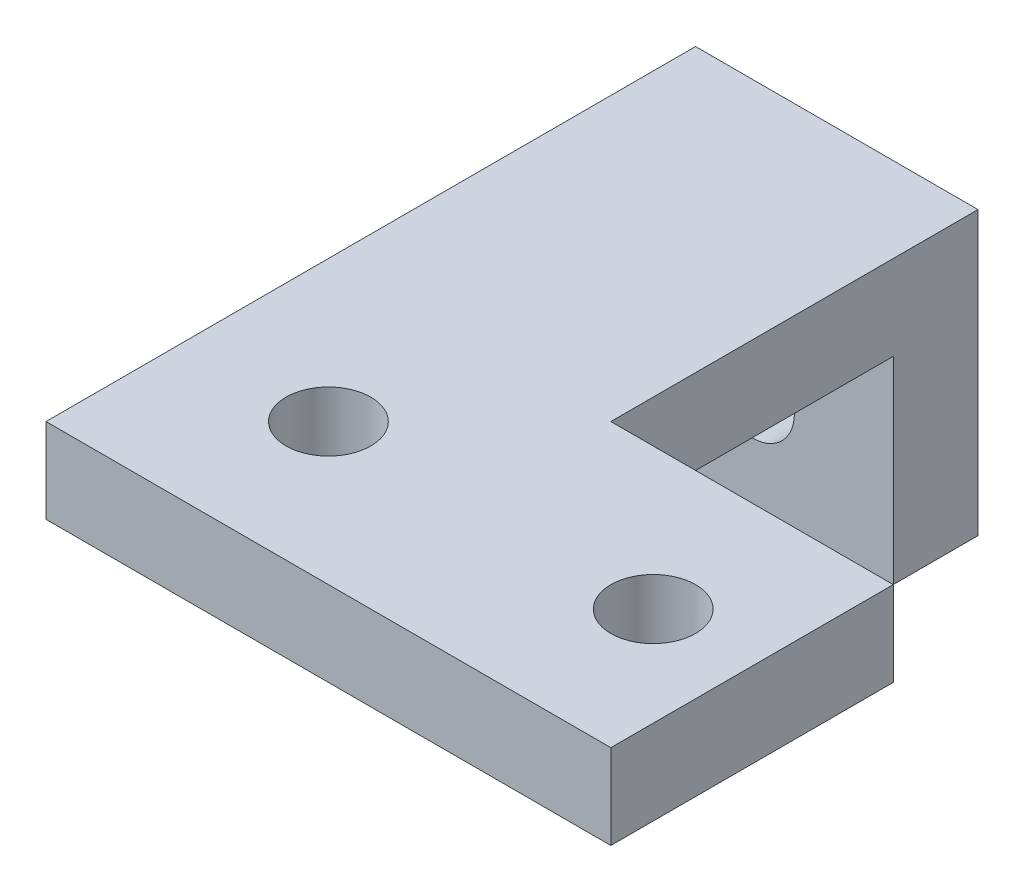
ISO-10303-21;
HEADER;
FILE_DESCRIPTION(('STEP AP214'),'2;1');
FILE_NAME('part.step','',(''),(''),'','','');
FILE_SCHEMA(('AUTOMOTIVE_DESIGN { 1 0 10303 214 1 1 1 1 }'));
ENDSEC;
DATA;
#1=APPLICATION_CONTEXT('core data for automotive mechanical design processes');
#2=APPLICATION_PROTOCOL_DEFINITION('international standard','automotive_design',2000,#1);
#3=PRODUCT_CONTEXT('',#1,'mechanical');
#4=PRODUCT('Part','Part','',(#3));
#5=PRODUCT_RELATED_PRODUCT_CATEGORY('part','',(#4));
#6=PRODUCT_DEFINITION_FORMATION('','',#4);
#7=PRODUCT_DEFINITION_CONTEXT('part definition',#1,'design');
#8=PRODUCT_DEFINITION('design','',#6,#7);
#9=PRODUCT_DEFINITION_SHAPE('','',#8);
#10=(LENGTH_UNIT() NAMED_UNIT(*) SI_UNIT(.MILLI.,.METRE.));
#11=(NAMED_UNIT(*) PLANE_ANGLE_UNIT() SI_UNIT($,.RADIAN.));
#12=(NAMED_UNIT(*) SI_UNIT($,.STERADIAN.) SOLID_ANGLE_UNIT());
#13=UNCERTAINTY_MEASURE_WITH_UNIT(LENGTH_MEASURE(1.E-05),#10,'distance_accuracy_value','');
#14=(GEOMETRIC_REPRESENTATION_CONTEXT(3) GLOBAL_UNCERTAINTY_ASSIGNED_CONTEXT((#13)) GLOBAL_UNIT_ASSIGNED_CONTEXT((#10,
#11,#12)) REPRESENTATION_CONTEXT('',''));
#15=CARTESIAN_POINT('',(0.,0.,0.));
#16=DIRECTION('',(0.,0.,1.));
#17=DIRECTION('',(1.,0.,0.));
#18=AXIS2_PLACEMENT_3D('',#15,#16,#17);
#19=CARTESIAN_POINT('',(9.99999999999979,3.,0.));
#20=DIRECTION('',(0.,0.,1.));
#21=DIRECTION('',(1.,0.,0.));
#22=AXIS2_PLACEMENT_3D('',#19,#20,#21);
#23=PLANE('',#22);
#24=DIRECTION('',(-1.,0.,0.));
#25=VECTOR('',#24,1.);
#26=CARTESIAN_POINT('',(9.99999999999979,0.,0.));
#27=LINE('',#26,#25);
#28=CARTESIAN_POINT('',(9.99999999999979,0.,0.));
#29=VERTEX_POINT('',#28);
#30=CARTESIAN_POINT('',(0.,0.,0.));
#31=VERTEX_POINT('',#30);
#32=EDGE_CURVE('E141',#29,#31,#27,.T.);
#33=ORIENTED_EDGE('',*,*,#32,.T.);
#34=DIRECTION('',(0.,-1.,0.));
#35=VECTOR('',#34,1.);
#36=CARTESIAN_POINT('',(0.,3.,0.));
#37=LINE('',#36,#35);
#38=CARTESIAN_POINT('',(0.,3.,0.));
#39=VERTEX_POINT('',#38);
#40=EDGE_CURVE('E11',#39,#31,#37,.T.);
#41=ORIENTED_EDGE('',*,*,#40,.F.);
#42=DIRECTION('',(-1.,0.,0.));
#43=VECTOR('',#42,1.);
#44=CARTESIAN_POINT('',(9.99999999999979,3.,0.));
#45=LINE('',#44,#43);
#46=CARTESIAN_POINT('',(9.99999999999979,3.,0.));
#47=VERTEX_POINT('',#46);
#48=EDGE_CURVE('E146',#47,#39,#45,.T.);
#49=ORIENTED_EDGE('',*,*,#48,.F.);
#50=DIRECTION('',(0.,-1.,0.));
#51=VECTOR('',#50,1.);
#52=CARTESIAN_POINT('',(9.99999999999979,3.,0.));
#53=LINE('',#52,#51);
#54=EDGE_CURVE('E154',#47,#29,#53,.T.);
#55=ORIENTED_EDGE('',*,*,#54,.T.);
#56=EDGE_LOOP('',(#33,#41,#49,#55));
#57=FACE_BOUND('',#56,.T.);
#58=ADVANCED_FACE('F33',(#57),#23,.F.);
#59=CARTESIAN_POINT('',(0.,3.,0.));
#60=DIRECTION('',(-1.,0.,0.));
#61=DIRECTION('',(0.,0.,1.));
#62=AXIS2_PLACEMENT_3D('',#59,#60,#61);
#63=PLANE('',#62);
#64=DIRECTION('',(0.,0.,-1.));
#65=VECTOR('',#64,1.);
#66=CARTESIAN_POINT('',(0.,0.,0.));
#67=LINE('',#66,#65);
#68=CARTESIAN_POINT('',(-2.1163626406917E-13,0.,-9.99999999999998));
#69=VERTEX_POINT('',#68);
#70=EDGE_CURVE('E157',#31,#69,#67,.T.);
#71=ORIENTED_EDGE('',*,*,#70,.T.);
#72=DIRECTION('',(0.,1.,0.));
#73=VECTOR('',#72,1.);
#74=CARTESIAN_POINT('',(-2.1163626406917E-13,-7.,-9.99999999999998));
#75=LINE('',#74,#73);
#76=CARTESIAN_POINT('',(-2.1163626406917E-13,-7.,-9.99999999999998));
#77=VERTEX_POINT('',#76);
#78=EDGE_CURVE('E130',#77,#69,#75,.T.);
#79=ORIENTED_EDGE('',*,*,#78,.F.);
#80=DIRECTION('',(0.,0.,-1.));
#81=VECTOR('',#80,1.);
#82=CARTESIAN_POINT('',(-2.1163626406917E-13,-7.,-9.99999999999998));
#83=LINE('',#82,#81);
#84=CARTESIAN_POINT('',(-2.1163626406917E-13,-7.,-13.));
#85=VERTEX_POINT('',#84);
#86=EDGE_CURVE('E123',#77,#85,#83,.T.);
#87=ORIENTED_EDGE('',*,*,#86,.T.);
#88=DIRECTION('',(0.,1.,0.));
#89=VECTOR('',#88,1.);
#90=CARTESIAN_POINT('',(-2.1163626406917E-13,-7.,-13.));
#91=LINE('',#90,#89);
#92=CARTESIAN_POINT('',(-2.1163626406917E-13,3.,-13.));
#93=VERTEX_POINT('',#92);
#94=EDGE_CURVE('E107',#85,#93,#91,.T.);
#95=ORIENTED_EDGE('',*,*,#94,.T.);
#96=DIRECTION('',(0.,0.,-1.));
#97=VECTOR('',#96,1.);
#98=CARTESIAN_POINT('',(0.,3.,0.));
#99=LINE('',#98,#97);
#100=EDGE_CURVE('E83',#39,#93,#99,.T.);
#101=ORIENTED_EDGE('',*,*,#100,.F.);
#102=ORIENTED_EDGE('',*,*,#40,.T.);
#103=EDGE_LOOP('',(#71,#79,#87,#95,#101,#102));
#104=FACE_BOUND('',#103,.T.);
#105=ADVANCED_FACE('F128',(#104),#63,.F.);
#106=CARTESIAN_POINT('',(-10.0000000000002,3.,-9.99999999999998));
#107=DIRECTION('',(1.,0.,0.));
#108=DIRECTION('',(0.,0.,-1.));
#109=AXIS2_PLACEMENT_3D('',#106,#107,#108);
#110=PLANE('',#109);
#111=DIRECTION('',(0.,0.,1.));
#112=VECTOR('',#111,1.);
#113=CARTESIAN_POINT('',(-10.0000000000002,0.,-9.99999999999998));
#114=LINE('',#113,#112);
#115=CARTESIAN_POINT('',(-10.0000000000002,0.,-9.99999999999998));
#116=VERTEX_POINT('',#115);
#117=CARTESIAN_POINT('',(-10.0000000000002,0.,10.));
#118=VERTEX_POINT('',#117);
#119=EDGE_CURVE('E162',#116,#118,#114,.T.);
#120=ORIENTED_EDGE('',*,*,#119,.T.);
#121=DIRECTION('',(0.,-1.,0.));
#122=VECTOR('',#121,1.);
#123=CARTESIAN_POINT('',(-10.0000000000002,3.,10.));
#124=LINE('',#123,#122);
#125=CARTESIAN_POINT('',(-10.0000000000002,3.,10.));
#126=VERTEX_POINT('',#125);
#127=EDGE_CURVE('E41',#126,#118,#124,.T.);
#128=ORIENTED_EDGE('',*,*,#127,.F.);
#129=DIRECTION('',(0.,0.,1.));
#130=VECTOR('',#129,1.);
#131=CARTESIAN_POINT('',(-10.0000000000002,3.,-9.99999999999998));
#132=LINE('',#131,#130);
#133=CARTESIAN_POINT('',(-10.0000000000002,3.,-13.));
#134=VERTEX_POINT('',#133);
#135=EDGE_CURVE('E149',#134,#126,#132,.T.);
#136=ORIENTED_EDGE('',*,*,#135,.F.);
#137=DIRECTION('',(0.,1.,0.));
#138=VECTOR('',#137,1.);
#139=CARTESIAN_POINT('',(-10.0000000000002,-7.,-13.));
#140=LINE('',#139,#138);
#141=CARTESIAN_POINT('',(-10.0000000000002,-7.,-13.));
#142=VERTEX_POINT('',#141);
#143=EDGE_CURVE('E115',#142,#134,#140,.T.);
#144=ORIENTED_EDGE('',*,*,#143,.F.);
#145=DIRECTION('',(0.,0.,1.));
#146=VECTOR('',#145,1.);
#147=CARTESIAN_POINT('',(-10.0000000000002,-7.,-9.99999999999998));
#148=LINE('',#147,#146);
#149=CARTESIAN_POINT('',(-10.0000000000002,-7.,-9.99999999999998));
#150=VERTEX_POINT('',#149);
#151=EDGE_CURVE('E126',#142,#150,#148,.T.);
#152=ORIENTED_EDGE('',*,*,#151,.T.);
#153=DIRECTION('',(0.,1.,0.));
#154=VECTOR('',#153,1.);
#155=CARTESIAN_POINT('',(-10.0000000000002,-7.,-9.99999999999998));
#156=LINE('',#155,#154);
#157=EDGE_CURVE('E142',#150,#116,#156,.T.);
#158=ORIENTED_EDGE('',*,*,#157,.T.);
#159=EDGE_LOOP('',(#120,#128,#136,#144,#152,#158));
#160=FACE_BOUND('',#159,.T.);
#161=ADVANCED_FACE('F189',(#160),#110,.F.);
#162=CARTESIAN_POINT('',(-10.0000000000002,3.,10.));
#163=DIRECTION('',(0.,0.,-1.));
#164=DIRECTION('',(-1.,0.,0.));
#165=AXIS2_PLACEMENT_3D('',#162,#163,#164);
#166=PLANE('',#165);
#167=DIRECTION('',(1.,0.,0.));
#168=VECTOR('',#167,1.);
#169=CARTESIAN_POINT('',(-10.0000000000002,0.,10.));
#170=LINE('',#169,#168);
#171=CARTESIAN_POINT('',(9.99999999999979,0.,10.));
#172=VERTEX_POINT('',#171);
#173=EDGE_CURVE('E70',#118,#172,#170,.T.);
#174=ORIENTED_EDGE('',*,*,#173,.T.);
#175=DIRECTION('',(0.,-1.,0.));
#176=VECTOR('',#175,1.);
#177=CARTESIAN_POINT('',(9.99999999999979,3.,10.));
#178=LINE('',#177,#176);
#179=CARTESIAN_POINT('',(9.99999999999979,3.,10.));
#180=VERTEX_POINT('',#179);
#181=EDGE_CURVE('E167',#180,#172,#178,.T.);
#182=ORIENTED_EDGE('',*,*,#181,.F.);
#183=DIRECTION('',(1.,0.,0.));
#184=VECTOR('',#183,1.);
#185=CARTESIAN_POINT('',(-10.0000000000002,3.,10.));
#186=LINE('',#185,#184);
#187=EDGE_CURVE('E151',#126,#180,#186,.T.);
#188=ORIENTED_EDGE('',*,*,#187,.F.);
#189=ORIENTED_EDGE('',*,*,#127,.T.);
#190=EDGE_LOOP('',(#174,#182,#188,#189));
#191=FACE_BOUND('',#190,.T.);
#192=ADVANCED_FACE('F170',(#191),#166,.F.);
#193=CARTESIAN_POINT('',(9.99999999999979,3.,10.));
#194=DIRECTION('',(-1.,0.,0.));
#195=DIRECTION('',(0.,0.,1.));
#196=AXIS2_PLACEMENT_3D('',#193,#194,#195);
#197=PLANE('',#196);
#198=DIRECTION('',(0.,0.,-1.));
#199=VECTOR('',#198,1.);
#200=CARTESIAN_POINT('',(9.99999999999979,0.,10.));
#201=LINE('',#200,#199);
#202=EDGE_CURVE('E76',#172,#29,#201,.T.);
#203=ORIENTED_EDGE('',*,*,#202,.T.);
#204=ORIENTED_EDGE('',*,*,#54,.F.);
#205=DIRECTION('',(0.,0.,-1.));
#206=VECTOR('',#205,1.);
#207=CARTESIAN_POINT('',(9.99999999999979,3.,10.));
#208=LINE('',#207,#206);
#209=EDGE_CURVE('E49',#180,#47,#208,.T.);
#210=ORIENTED_EDGE('',*,*,#209,.F.);
#211=ORIENTED_EDGE('',*,*,#181,.T.);
#212=EDGE_LOOP('',(#203,#204,#210,#211));
#213=FACE_BOUND('',#212,.T.);
#214=ADVANCED_FACE('F179',(#213),#197,.F.);
#215=CARTESIAN_POINT('',(0.,3.,0.));
#216=DIRECTION('',(0.,-1.,0.));
#217=DIRECTION('',(0.,0.,-1.));
#218=AXIS2_PLACEMENT_3D('',#215,#216,#217);
#219=PLANE('',#218);
#220=CARTESIAN_POINT('',(-5.,3.,5.00000000000001));
#221=DIRECTION('',(0.,1.,0.));
#222=DIRECTION('',(0.,0.,1.));
#223=AXIS2_PLACEMENT_3D('',#220,#221,#222);
#224=CIRCLE('',#223,1.5);
#225=CARTESIAN_POINT('',(-5.,3.,6.50000000000001));
#226=VERTEX_POINT('',#225);
#227=EDGE_CURVE('E132',#226,#226,#224,.T.);
#228=ORIENTED_EDGE('',*,*,#227,.F.);
#229=EDGE_LOOP('',(#228));
#230=FACE_BOUND('',#229,.T.);
#231=CARTESIAN_POINT('',(6.49999999999979,3.,5.00000000000001));
#232=DIRECTION('',(0.,1.,0.));
#233=DIRECTION('',(0.,0.,1.));
#234=AXIS2_PLACEMENT_3D('',#231,#232,#233);
#235=CIRCLE('',#234,1.5);
#236=CARTESIAN_POINT('',(6.49999999999979,3.,6.50000000000001));
#237=VERTEX_POINT('',#236);
#238=EDGE_CURVE('E239',#237,#237,#235,.T.);
#239=ORIENTED_EDGE('',*,*,#238,.F.);
#240=EDGE_LOOP('',(#239));
#241=FACE_BOUND('',#240,.T.);
#242=ORIENTED_EDGE('',*,*,#48,.T.);
#243=ORIENTED_EDGE('',*,*,#100,.T.);
#244=DIRECTION('',(-1.,0.,0.));
#245=VECTOR('',#244,1.);
#246=CARTESIAN_POINT('',(-2.1163626406917E-13,3.,-13.));
#247=LINE('',#246,#245);
#248=EDGE_CURVE('E113',#93,#134,#247,.T.);
#249=ORIENTED_EDGE('',*,*,#248,.T.);
#250=ORIENTED_EDGE('',*,*,#135,.T.);
#251=ORIENTED_EDGE('',*,*,#187,.T.);
#252=ORIENTED_EDGE('',*,*,#209,.T.);
#253=EDGE_LOOP('',(#242,#243,#249,#250,#251,#252));
#254=FACE_BOUND('',#253,.T.);
#255=ADVANCED_FACE('F181',(#230,#241,#254),#219,.F.);
#256=CARTESIAN_POINT('',(0.,0.,0.));
#257=DIRECTION('',(0.,-1.,0.));
#258=DIRECTION('',(0.,0.,-1.));
#259=AXIS2_PLACEMENT_3D('',#256,#257,#258);
#260=PLANE('',#259);
#261=CARTESIAN_POINT('',(-5.,0.,5.00000000000001));
#262=DIRECTION('',(0.,-1.,0.));
#263=DIRECTION('',(0.,0.,-1.));
#264=AXIS2_PLACEMENT_3D('',#261,#262,#263);
#265=CIRCLE('',#264,1.5);
#266=CARTESIAN_POINT('',(-5.,0.,3.50000000000001));
#267=VERTEX_POINT('',#266);
#268=EDGE_CURVE('E244',#267,#267,#265,.F.);
#269=ORIENTED_EDGE('',*,*,#268,.T.);
#270=EDGE_LOOP('',(#269));
#271=FACE_BOUND('',#270,.T.);
#272=CARTESIAN_POINT('',(6.49999999999979,0.,5.00000000000001));
#273=DIRECTION('',(0.,-1.,0.));
#274=DIRECTION('',(0.,0.,-1.));
#275=AXIS2_PLACEMENT_3D('',#272,#273,#274);
#276=CIRCLE('',#275,1.5);
#277=CARTESIAN_POINT('',(6.49999999999979,0.,3.50000000000001));
#278=VERTEX_POINT('',#277);
#279=EDGE_CURVE('E135',#278,#278,#276,.F.);
#280=ORIENTED_EDGE('',*,*,#279,.T.);
#281=EDGE_LOOP('',(#280));
#282=FACE_BOUND('',#281,.T.);
#283=ORIENTED_EDGE('',*,*,#32,.F.);
#284=ORIENTED_EDGE('',*,*,#202,.F.);
#285=ORIENTED_EDGE('',*,*,#173,.F.);
#286=ORIENTED_EDGE('',*,*,#119,.F.);
#287=DIRECTION('',(-1.,0.,0.));
#288=VECTOR('',#287,1.);
#289=CARTESIAN_POINT('',(-2.1163626406917E-13,0.,-9.99999999999998));
#290=LINE('',#289,#288);
#291=EDGE_CURVE('E159',#69,#116,#290,.T.);
#292=ORIENTED_EDGE('',*,*,#291,.F.);
#293=ORIENTED_EDGE('',*,*,#70,.F.);
#294=EDGE_LOOP('',(#283,#284,#285,#286,#292,#293));
#295=FACE_BOUND('',#294,.T.);
#296=ADVANCED_FACE('F174',(#271,#282,#295),#260,.T.);
#297=CARTESIAN_POINT('',(-2.1163626406917E-13,-7.,-9.99999999999998));
#298=DIRECTION('',(0.,0.,1.));
#299=DIRECTION('',(1.,0.,0.));
#300=AXIS2_PLACEMENT_3D('',#297,#298,#299);
#301=PLANE('',#300);
#302=CARTESIAN_POINT('',(-5.00000000000021,-3.5,-9.99999999999998));
#303=DIRECTION('',(0.,0.,1.));
#304=DIRECTION('',(1.,0.,0.));
#305=AXIS2_PLACEMENT_3D('',#302,#303,#304);
#306=CIRCLE('',#305,1.5);
#307=CARTESIAN_POINT('',(-3.50000000000021,-3.5,-9.99999999999998));
#308=VERTEX_POINT('',#307);
#309=EDGE_CURVE('E233',#308,#308,#306,.F.);
#310=ORIENTED_EDGE('',*,*,#309,.T.);
#311=EDGE_LOOP('',(#310));
#312=FACE_BOUND('',#311,.T.);
#313=ORIENTED_EDGE('',*,*,#78,.T.);
#314=ORIENTED_EDGE('',*,*,#291,.T.);
#315=ORIENTED_EDGE('',*,*,#157,.F.);
#316=DIRECTION('',(1.,0.,0.));
#317=VECTOR('',#316,1.);
#318=CARTESIAN_POINT('',(-2.1163626406917E-13,-7.,-9.99999999999998));
#319=LINE('',#318,#317);
#320=EDGE_CURVE('E116',#150,#77,#319,.T.);
#321=ORIENTED_EDGE('',*,*,#320,.T.);
#322=EDGE_LOOP('',(#313,#314,#315,#321));
#323=FACE_BOUND('',#322,.T.);
#324=ADVANCED_FACE('F203',(#312,#323),#301,.T.);
#325=CARTESIAN_POINT('',(-2.1163626406917E-13,-7.,-13.));
#326=DIRECTION('',(0.,0.,-1.));
#327=DIRECTION('',(-1.,0.,0.));
#328=AXIS2_PLACEMENT_3D('',#325,#326,#327);
#329=PLANE('',#328);
#330=CARTESIAN_POINT('',(-5.00000000000021,-3.5,-13.));
#331=DIRECTION('',(0.,0.,-1.));
#332=DIRECTION('',(-1.,0.,0.));
#333=AXIS2_PLACEMENT_3D('',#330,#331,#332);
#334=CIRCLE('',#333,1.5);
#335=CARTESIAN_POINT('',(-6.50000000000021,-3.5,-13.));
#336=VERTEX_POINT('',#335);
#337=EDGE_CURVE('E236',#336,#336,#334,.T.);
#338=ORIENTED_EDGE('',*,*,#337,.F.);
#339=EDGE_LOOP('',(#338));
#340=FACE_BOUND('',#339,.T.);
#341=ORIENTED_EDGE('',*,*,#248,.F.);
#342=ORIENTED_EDGE('',*,*,#94,.F.);
#343=DIRECTION('',(-1.,0.,0.));
#344=VECTOR('',#343,1.);
#345=CARTESIAN_POINT('',(-2.1163626406917E-13,-7.,-13.));
#346=LINE('',#345,#344);
#347=EDGE_CURVE('E111',#85,#142,#346,.T.);
#348=ORIENTED_EDGE('',*,*,#347,.T.);
#349=ORIENTED_EDGE('',*,*,#143,.T.);
#350=EDGE_LOOP('',(#341,#342,#348,#349));
#351=FACE_BOUND('',#350,.T.);
#352=ADVANCED_FACE('F109',(#340,#351),#329,.T.);
#353=CARTESIAN_POINT('',(0.,-7.,0.));
#354=DIRECTION('',(0.,1.,0.));
#355=DIRECTION('',(0.,0.,1.));
#356=AXIS2_PLACEMENT_3D('',#353,#354,#355);
#357=PLANE('',#356);
#358=ORIENTED_EDGE('',*,*,#86,.F.);
#359=ORIENTED_EDGE('',*,*,#320,.F.);
#360=ORIENTED_EDGE('',*,*,#151,.F.);
#361=ORIENTED_EDGE('',*,*,#347,.F.);
#362=EDGE_LOOP('',(#358,#359,#360,#361));
#363=FACE_BOUND('',#362,.T.);
#364=ADVANCED_FACE('F121',(#363),#357,.F.);
#365=CARTESIAN_POINT('',(6.49999999999979,-7.001,5.00000000000001));
#366=DIRECTION('',(0.,1.,0.));
#367=DIRECTION('',(0.,0.,1.));
#368=AXIS2_PLACEMENT_3D('',#365,#366,#367);
#369=CYLINDRICAL_SURFACE('',#368,1.5);
#370=ORIENTED_EDGE('',*,*,#279,.F.);
#371=EDGE_LOOP('',(#370));
#372=FACE_BOUND('',#371,.T.);
#373=ORIENTED_EDGE('',*,*,#238,.T.);
#374=EDGE_LOOP('',(#373));
#375=FACE_BOUND('',#374,.T.);
#376=ADVANCED_FACE('F218',(#372,#375),#369,.F.);
#377=CARTESIAN_POINT('',(-5.,-7.001,5.00000000000001));
#378=DIRECTION('',(0.,1.,0.));
#379=DIRECTION('',(0.,0.,1.));
#380=AXIS2_PLACEMENT_3D('',#377,#378,#379);
#381=CYLINDRICAL_SURFACE('',#380,1.5);
#382=ORIENTED_EDGE('',*,*,#268,.F.);
#383=EDGE_LOOP('',(#382));
#384=FACE_BOUND('',#383,.T.);
#385=ORIENTED_EDGE('',*,*,#227,.T.);
#386=EDGE_LOOP('',(#385));
#387=FACE_BOUND('',#386,.T.);
#388=ADVANCED_FACE('F221',(#384,#387),#381,.F.);
#389=CARTESIAN_POINT('',(-5.00000000000021,-3.5,10.001));
#390=DIRECTION('',(0.,0.,-1.));
#391=DIRECTION('',(-1.,0.,0.));
#392=AXIS2_PLACEMENT_3D('',#389,#390,#391);
#393=CYLINDRICAL_SURFACE('',#392,1.5);
#394=ORIENTED_EDGE('',*,*,#309,.F.);
#395=EDGE_LOOP('',(#394));
#396=FACE_BOUND('',#395,.T.);
#397=ORIENTED_EDGE('',*,*,#337,.T.);
#398=EDGE_LOOP('',(#397));
#399=FACE_BOUND('',#398,.T.);
#400=ADVANCED_FACE('F225',(#396,#399),#393,.F.);
#401=CLOSED_SHELL('',(#58,#105,#161,#192,#214,#255,#296,#324,#352,#364,#376,#388,#400));
#402=MANIFOLD_SOLID_BREP('B2',#401);
#403=ADVANCED_BREP_SHAPE_REPRESENTATION('',(#18,#402),#14);
#404=SHAPE_DEFINITION_REPRESENTATION(#9,#403);
ENDSEC;
END-ISO-10303-21;
